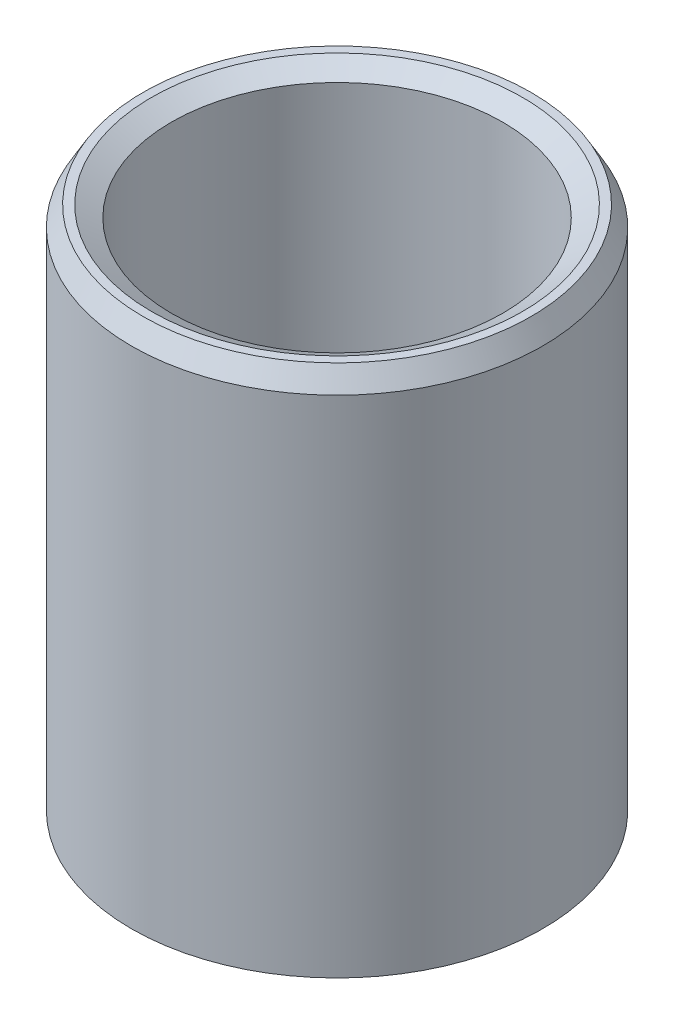
ISO-10303-21;
HEADER;
FILE_DESCRIPTION(('STEP AP214'),'2;1');
FILE_NAME('part.step','',(''),(''),'','','');
FILE_SCHEMA(('AUTOMOTIVE_DESIGN { 1 0 10303 214 1 1 1 1 }'));
ENDSEC;
DATA;
#1=APPLICATION_CONTEXT('core data for automotive mechanical design processes');
#2=APPLICATION_PROTOCOL_DEFINITION('international standard','automotive_design',2000,#1);
#3=PRODUCT_CONTEXT('',#1,'mechanical');
#4=PRODUCT('Part','Part','',(#3));
#5=PRODUCT_RELATED_PRODUCT_CATEGORY('part','',(#4));
#6=PRODUCT_DEFINITION_FORMATION('','',#4);
#7=PRODUCT_DEFINITION_CONTEXT('part definition',#1,'design');
#8=PRODUCT_DEFINITION('design','',#6,#7);
#9=PRODUCT_DEFINITION_SHAPE('','',#8);
#10=(LENGTH_UNIT() NAMED_UNIT(*) SI_UNIT(.MILLI.,.METRE.));
#11=(NAMED_UNIT(*) PLANE_ANGLE_UNIT() SI_UNIT($,.RADIAN.));
#12=(NAMED_UNIT(*) SI_UNIT($,.STERADIAN.) SOLID_ANGLE_UNIT());
#13=UNCERTAINTY_MEASURE_WITH_UNIT(LENGTH_MEASURE(1.E-05),#10,'distance_accuracy_value','');
#14=(GEOMETRIC_REPRESENTATION_CONTEXT(3) GLOBAL_UNCERTAINTY_ASSIGNED_CONTEXT((#13)) GLOBAL_UNIT_ASSIGNED_CONTEXT((#10,
#11,#12)) REPRESENTATION_CONTEXT('',''));
#15=CARTESIAN_POINT('',(0.,0.,0.));
#16=DIRECTION('',(0.,0.,1.));
#17=DIRECTION('',(1.,0.,0.));
#18=AXIS2_PLACEMENT_3D('',#15,#16,#17);
#19=CARTESIAN_POINT('',(0.,91.2671339394399,0.));
#20=DIRECTION('',(0.,-1.,0.));
#21=DIRECTION('',(0.,0.,-1.));
#22=AXIS2_PLACEMENT_3D('',#19,#20,#21);
#23=CYLINDRICAL_SURFACE('',#22,35.);
#24=CARTESIAN_POINT('',(0.,1.9535176255974,0.));
#25=DIRECTION('',(0.,1.,0.));
#26=DIRECTION('',(0.,0.,1.));
#27=AXIS2_PLACEMENT_3D('',#24,#25,#26);
#28=CIRCLE('',#27,35.);
#29=CARTESIAN_POINT('',(0.,1.9535176255974,35.));
#30=VERTEX_POINT('',#29);
#31=EDGE_CURVE('E10',#30,#30,#28,.T.);
#32=ORIENTED_EDGE('',*,*,#31,.T.);
#33=EDGE_LOOP('',(#32));
#34=FACE_BOUND('',#33,.T.);
#35=CARTESIAN_POINT('',(0.,87.8835421584239,0.));
#36=DIRECTION('',(0.,1.,0.));
#37=DIRECTION('',(0.,0.,1.));
#38=AXIS2_PLACEMENT_3D('',#35,#36,#37);
#39=CIRCLE('',#38,35.);
#40=CARTESIAN_POINT('',(0.,87.8835421584239,35.));
#41=VERTEX_POINT('',#40);
#42=EDGE_CURVE('E50',#41,#41,#39,.F.);
#43=ORIENTED_EDGE('',*,*,#42,.T.);
#44=EDGE_LOOP('',(#43));
#45=FACE_BOUND('',#44,.T.);
#46=ADVANCED_FACE('F39',(#34,#45),#23,.T.);
#47=CARTESIAN_POINT('',(0.,91.2671339394399,0.));
#48=DIRECTION('',(0.,1.,0.));
#49=DIRECTION('',(0.,0.,1.));
#50=AXIS2_PLACEMENT_3D('',#47,#48,#49);
#51=PLANE('',#50);
#52=CARTESIAN_POINT('',(0.,91.2671339394399,0.));
#53=DIRECTION('',(0.,1.,0.));
#54=DIRECTION('',(0.,0.,1.));
#55=AXIS2_PLACEMENT_3D('',#52,#53,#54);
#56=CIRCLE('',#55,31.5858774160772);
#57=CARTESIAN_POINT('',(0.,91.2671339394399,31.5858774160772));
#58=VERTEX_POINT('',#57);
#59=EDGE_CURVE('E58',#58,#58,#56,.F.);
#60=ORIENTED_EDGE('',*,*,#59,.T.);
#61=EDGE_LOOP('',(#60));
#62=FACE_BOUND('',#61,.T.);
#63=CARTESIAN_POINT('',(0.,91.2671339394399,0.));
#64=DIRECTION('',(0.,1.,0.));
#65=DIRECTION('',(0.,0.,1.));
#66=AXIS2_PLACEMENT_3D('',#63,#64,#65);
#67=CIRCLE('',#66,33.0464823744026);
#68=CARTESIAN_POINT('',(0.,91.2671339394399,33.0464823744026));
#69=VERTEX_POINT('',#68);
#70=EDGE_CURVE('E61',#69,#69,#67,.T.);
#71=ORIENTED_EDGE('',*,*,#70,.T.);
#72=EDGE_LOOP('',(#71));
#73=FACE_BOUND('',#72,.T.);
#74=ADVANCED_FACE('F88',(#62,#73),#51,.T.);
#75=CARTESIAN_POINT('',(0.,0.,0.));
#76=DIRECTION('',(0.,1.,0.));
#77=DIRECTION('',(0.,0.,1.));
#78=AXIS2_PLACEMENT_3D('',#75,#76,#77);
#79=PLANE('',#78);
#80=CARTESIAN_POINT('',(0.,0.,0.));
#81=DIRECTION('',(0.,1.,0.));
#82=DIRECTION('',(0.,0.,1.));
#83=AXIS2_PLACEMENT_3D('',#80,#81,#82);
#84=CIRCLE('',#83,30.1558032606586);
#85=CARTESIAN_POINT('',(0.,0.,-30.1558032606586));
#86=VERTEX_POINT('',#85);
#87=EDGE_CURVE('E51',#86,#86,#84,.T.);
#88=ORIENTED_EDGE('',*,*,#87,.T.);
#89=EDGE_LOOP('',(#88));
#90=FACE_BOUND('',#89,.T.);
#91=CARTESIAN_POINT('',(0.,0.,0.));
#92=DIRECTION('',(0.,1.,0.));
#93=DIRECTION('',(0.,0.,1.));
#94=AXIS2_PLACEMENT_3D('',#91,#92,#93);
#95=CIRCLE('',#94,31.616408218984);
#96=CARTESIAN_POINT('',(0.,0.,31.616408218984));
#97=VERTEX_POINT('',#96);
#98=EDGE_CURVE('E54',#97,#97,#95,.F.);
#99=ORIENTED_EDGE('',*,*,#98,.T.);
#100=EDGE_LOOP('',(#99));
#101=FACE_BOUND('',#100,.T.);
#102=ADVANCED_FACE('F83',(#90,#101),#79,.F.);
#103=CARTESIAN_POINT('',(0.,91.2671339394399,0.));
#104=DIRECTION('',(0.,-1.,0.));
#105=DIRECTION('',(0.,0.,-1.));
#106=AXIS2_PLACEMENT_3D('',#103,#104,#105);
#107=CYLINDRICAL_SURFACE('',#106,28.2022856350612);
#108=CARTESIAN_POINT('',(0.,89.3136163138425,0.));
#109=DIRECTION('',(0.,1.,0.));
#110=DIRECTION('',(0.,0.,1.));
#111=AXIS2_PLACEMENT_3D('',#108,#109,#110);
#112=CIRCLE('',#111,28.2022856350612);
#113=CARTESIAN_POINT('',(0.,89.3136163138425,28.2022856350612));
#114=VERTEX_POINT('',#113);
#115=EDGE_CURVE('E67',#114,#114,#112,.T.);
#116=ORIENTED_EDGE('',*,*,#115,.T.);
#117=EDGE_LOOP('',(#116));
#118=FACE_BOUND('',#117,.T.);
#119=CARTESIAN_POINT('',(0.,3.38359178101603,0.));
#120=DIRECTION('',(0.,1.,0.));
#121=DIRECTION('',(0.,0.,1.));
#122=AXIS2_PLACEMENT_3D('',#119,#120,#121);
#123=CIRCLE('',#122,28.2022856350612);
#124=CARTESIAN_POINT('',(0.,3.38359178101603,-28.2022856350612));
#125=VERTEX_POINT('',#124);
#126=EDGE_CURVE('E69',#125,#125,#123,.F.);
#127=ORIENTED_EDGE('',*,*,#126,.T.);
#128=EDGE_LOOP('',(#127));
#129=FACE_BOUND('',#128,.T.);
#130=ADVANCED_FACE('F71',(#118,#129),#107,.F.);
#131=CARTESIAN_POINT('',(0.,89.3136163138425,0.));
#132=DIRECTION('',(0.,1.,0.));
#133=DIRECTION('',(0.,0.,1.));
#134=AXIS2_PLACEMENT_3D('',#131,#132,#133);
#135=CONICAL_SURFACE('',#134,28.2022856350612,1.0471975511966);
#136=ORIENTED_EDGE('',*,*,#59,.F.);
#137=EDGE_LOOP('',(#136));
#138=FACE_BOUND('',#137,.T.);
#139=ORIENTED_EDGE('',*,*,#115,.F.);
#140=EDGE_LOOP('',(#139));
#141=FACE_BOUND('',#140,.T.);
#142=ADVANCED_FACE('F77',(#138,#141),#135,.F.);
#143=CARTESIAN_POINT('',(0.,0.,0.));
#144=DIRECTION('',(0.,-1.,0.));
#145=DIRECTION('',(0.,0.,-1.));
#146=AXIS2_PLACEMENT_3D('',#143,#144,#145);
#147=CONICAL_SURFACE('',#146,30.1558032606586,0.523598775598294);
#148=CARTESIAN_POINT('',(0.,3.38359178101603,-28.2022856350612));
#149=CARTESIAN_POINT('',(0.,3.34834603329712,-28.2226347769945));
#150=CARTESIAN_POINT('',(0.,3.3131002855782,-28.2429839189278));
#151=CARTESIAN_POINT('',(0.,3.24260879014037,-28.2836822027944));
#152=CARTESIAN_POINT('',(0.,3.20736304242145,-28.3040313447277));
#153=CARTESIAN_POINT('',(0.,3.13687154698362,-28.3447296285943));
#154=CARTESIAN_POINT('',(0.,3.1016257992647,-28.3650787705276));
#155=CARTESIAN_POINT('',(0.,3.03113430382686,-28.4057770543942));
#156=CARTESIAN_POINT('',(0.,2.99588855610795,-28.4261261963276));
#157=CARTESIAN_POINT('',(0.,2.92539706067011,-28.4668244801942));
#158=CARTESIAN_POINT('',(0.,2.8901513129512,-28.4871736221275));
#159=CARTESIAN_POINT('',(0.,2.81965981751336,-28.5278719059941));
#160=CARTESIAN_POINT('',(0.,2.78441406979445,-28.5482210479274));
#161=CARTESIAN_POINT('',(0.,2.71392257435661,-28.588919331794));
#162=CARTESIAN_POINT('',(0.,2.67867682663769,-28.6092684737273));
#163=CARTESIAN_POINT('',(0.,2.60818533119986,-28.6499667575939));
#164=CARTESIAN_POINT('',(0.,2.57293958348094,-28.6703158995272));
#165=CARTESIAN_POINT('',(0.,2.50244808804311,-28.7110141833938));
#166=CARTESIAN_POINT('',(0.,2.46720234032419,-28.7313633253271));
#167=CARTESIAN_POINT('',(0.,2.39671084488636,-28.7720616091938));
#168=CARTESIAN_POINT('',(0.,2.36146509716744,-28.7924107511271));
#169=CARTESIAN_POINT('',(0.,2.29097360172961,-28.8331090349937));
#170=CARTESIAN_POINT('',(0.,2.25572785401069,-28.853458176927));
#171=CARTESIAN_POINT('',(0.,2.18523635857286,-28.8941564607936));
#172=CARTESIAN_POINT('',(0.,2.14999061085394,-28.9145056027269));
#173=CARTESIAN_POINT('',(0.,2.0794991154161,-28.9552038865935));
#174=CARTESIAN_POINT('',(0.,2.04425336769719,-28.9755530285268));
#175=CARTESIAN_POINT('',(0.,1.97376187225935,-29.0162513123934));
#176=CARTESIAN_POINT('',(0.,1.93851612454044,-29.0366004543267));
#177=CARTESIAN_POINT('',(0.,1.8680246291026,-29.0772987381933));
#178=CARTESIAN_POINT('',(0.,1.83277888138369,-29.0976478801267));
#179=CARTESIAN_POINT('',(0.,1.76228738594585,-29.1383461639933));
#180=CARTESIAN_POINT('',(0.,1.72704163822693,-29.1586953059266));
#181=CARTESIAN_POINT('',(0.,1.6565501427891,-29.1993935897932));
#182=CARTESIAN_POINT('',(0.,1.62130439507018,-29.2197427317265));
#183=CARTESIAN_POINT('',(0.,1.55081289963235,-29.2604410155931));
#184=CARTESIAN_POINT('',(0.,1.51556715191343,-29.2807901575264));
#185=CARTESIAN_POINT('',(0.,1.4450756564756,-29.321488441393));
#186=CARTESIAN_POINT('',(0.,1.40982990875668,-29.3418375833263));
#187=CARTESIAN_POINT('',(0.,1.33933841331885,-29.3825358671929));
#188=CARTESIAN_POINT('',(0.,1.30409266559993,-29.4028850091262));
#189=CARTESIAN_POINT('',(0.,1.2336011701621,-29.4435832929929));
#190=CARTESIAN_POINT('',(0.,1.19835542244318,-29.4639324349262));
#191=CARTESIAN_POINT('',(0.,1.12786392700534,-29.5046307187928));
#192=CARTESIAN_POINT('',(0.,1.09261817928643,-29.5249798607261));
#193=CARTESIAN_POINT('',(0.,1.02212668384859,-29.5656781445927));
#194=CARTESIAN_POINT('',(0.,0.986880936129677,-29.586027286526));
#195=CARTESIAN_POINT('',(0.,0.916389440691843,-29.6267255703926));
#196=CARTESIAN_POINT('',(0.,0.881143692972926,-29.6470747123259));
#197=CARTESIAN_POINT('',(0.,0.810652197535092,-29.6877729961925));
#198=CARTESIAN_POINT('',(0.,0.775406449816174,-29.7081221381258));
#199=CARTESIAN_POINT('',(0.,0.70491495437834,-29.7488204219924));
#200=CARTESIAN_POINT('',(0.,0.669669206659424,-29.7691695639258));
#201=CARTESIAN_POINT('',(0.,0.59917771122159,-29.8098678477924));
#202=CARTESIAN_POINT('',(0.,0.563931963502672,-29.8302169897257));
#203=CARTESIAN_POINT('',(0.,0.493440468064838,-29.8709152735923));
#204=CARTESIAN_POINT('',(0.,0.458194720345921,-29.8912644155256));
#205=CARTESIAN_POINT('',(0.,0.387703224908087,-29.9319626993922));
#206=CARTESIAN_POINT('',(0.,0.35245747718917,-29.9523118413255));
#207=CARTESIAN_POINT('',(0.,0.281965981751336,-29.9930101251921));
#208=CARTESIAN_POINT('',(0.,0.246720234032419,-30.0133592671254));
#209=CARTESIAN_POINT('',(0.,0.176228738594585,-30.054057550992));
#210=CARTESIAN_POINT('',(0.,0.140982990875668,-30.0744066929254));
#211=CARTESIAN_POINT('',(0.,0.0704914954378339,-30.115104976792));
#212=CARTESIAN_POINT('',(0.,0.0352457477189167,-30.1354541187253));
#213=CARTESIAN_POINT('',(0.,0.,-30.1558032606586));
#214=B_SPLINE_CURVE_WITH_KNOTS('',3,(#148,#149,#150,#151,#152,#153,#154,#155,#156,#157,#158,
#159,#160,#161,#162,#163,#164,#165,#166,#167,#168,#169,#170,#171,#172,#173,#174,#175,#176,#177,
#178,#179,#180,#181,#182,#183,#184,#185,#186,#187,#188,#189,#190,#191,#192,#193,#194,#195,#196,
#197,#198,#199,#200,#201,#202,#203,#204,#205,#206,#207,#208,#209,#210,#211,#212,#213),
.UNSPECIFIED.,.F.,.F.,(4,2,2,2,2,2,2,2,2,2,2,2,2,2,2,2,2,2,2,2,2,2,2,2,2,2,2,2,2,2,2,2,4),(0.,
0.122094851599838,0.244189703199675,0.366284554799514,0.488379406399352,0.61047425799919,
0.732569109599027,0.854663961198865,0.976758812798704,1.09885366439854,1.22094851599838,
1.34304336759822,1.46513821919806,1.58723307079789,1.70932792239773,1.83142277399757,
1.95351762559741,2.07561247719725,2.19770732879708,2.31980218039692,2.44189703199676,
2.5639918835966,2.68608673519644,2.80818158679627,2.93027643839611,3.05237128999595,
3.17446614159579,3.29656099319563,3.41865584479546,3.5407506963953,3.66284554799514,
3.78494039959498,3.90703525119482),.UNSPECIFIED.);
#215=EDGE_CURVE('BSEAM73',#125,#86,#214,.T.);
#216=ORIENTED_EDGE('',*,*,#126,.F.);
#217=ORIENTED_EDGE('',*,*,#87,.F.);
#218=ORIENTED_EDGE('',*,*,#215,.T.);
#219=ORIENTED_EDGE('',*,*,#215,.F.);
#220=EDGE_LOOP('',(#216,#218,#217,#219));
#221=FACE_BOUND('',#220,.T.);
#222=ADVANCED_FACE('F73',(#221),#147,.F.);
#223=CARTESIAN_POINT('',(0.,1.9535176255974,0.));
#224=DIRECTION('',(0.,1.,0.));
#225=DIRECTION('',(0.,0.,1.));
#226=AXIS2_PLACEMENT_3D('',#223,#224,#225);
#227=CONICAL_SURFACE('',#226,35.,1.0471975511966);
#228=ORIENTED_EDGE('',*,*,#98,.F.);
#229=EDGE_LOOP('',(#228));
#230=FACE_BOUND('',#229,.T.);
#231=ORIENTED_EDGE('',*,*,#31,.F.);
#232=EDGE_LOOP('',(#231));
#233=FACE_BOUND('',#232,.T.);
#234=ADVANCED_FACE('F76',(#230,#233),#227,.T.);
#235=CARTESIAN_POINT('',(0.,91.2671339394399,0.));
#236=DIRECTION('',(0.,-1.,0.));
#237=DIRECTION('',(0.,0.,-1.));
#238=AXIS2_PLACEMENT_3D('',#235,#236,#237);
#239=CONICAL_SURFACE('',#238,33.0464823744026,0.523598775598298);
#240=ORIENTED_EDGE('',*,*,#42,.F.);
#241=EDGE_LOOP('',(#240));
#242=FACE_BOUND('',#241,.T.);
#243=ORIENTED_EDGE('',*,*,#70,.F.);
#244=EDGE_LOOP('',(#243));
#245=FACE_BOUND('',#244,.T.);
#246=ADVANCED_FACE('F45',(#242,#245),#239,.T.);
#247=CLOSED_SHELL('',(#46,#74,#102,#130,#142,#222,#234,#246));
#248=MANIFOLD_SOLID_BREP('B2',#247);
#249=ADVANCED_BREP_SHAPE_REPRESENTATION('',(#18,#248),#14);
#250=SHAPE_DEFINITION_REPRESENTATION(#9,#249);
ENDSEC;
END-ISO-10303-21;
